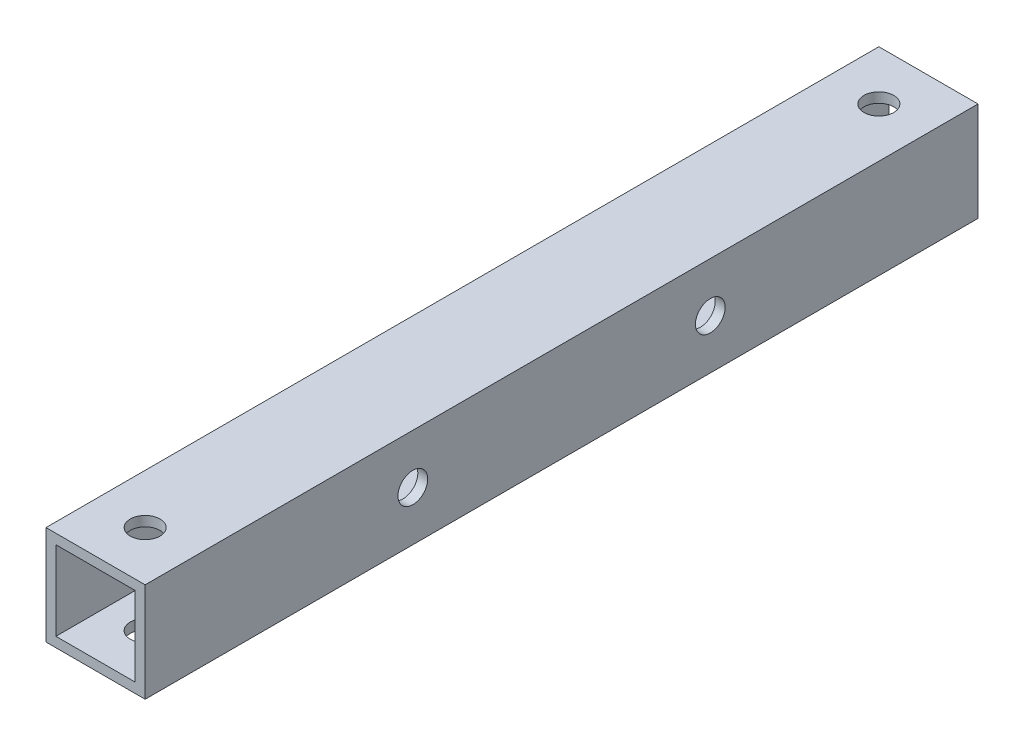
ISO-10303-21;
HEADER;
FILE_DESCRIPTION(('STEP AP214'),'2;1');
FILE_NAME('part.step','',(''),(''),'','','');
FILE_SCHEMA(('AUTOMOTIVE_DESIGN { 1 0 10303 214 1 1 1 1 }'));
ENDSEC;
DATA;
#1=APPLICATION_CONTEXT('core data for automotive mechanical design processes');
#2=APPLICATION_PROTOCOL_DEFINITION('international standard','automotive_design',2000,#1);
#3=PRODUCT_CONTEXT('',#1,'mechanical');
#4=PRODUCT('Part','Part','',(#3));
#5=PRODUCT_RELATED_PRODUCT_CATEGORY('part','',(#4));
#6=PRODUCT_DEFINITION_FORMATION('','',#4);
#7=PRODUCT_DEFINITION_CONTEXT('part definition',#1,'design');
#8=PRODUCT_DEFINITION('design','',#6,#7);
#9=PRODUCT_DEFINITION_SHAPE('','',#8);
#10=(LENGTH_UNIT() NAMED_UNIT(*) SI_UNIT(.MILLI.,.METRE.));
#11=(NAMED_UNIT(*) PLANE_ANGLE_UNIT() SI_UNIT($,.RADIAN.));
#12=(NAMED_UNIT(*) SI_UNIT($,.STERADIAN.) SOLID_ANGLE_UNIT());
#13=UNCERTAINTY_MEASURE_WITH_UNIT(LENGTH_MEASURE(1.E-05),#10,'distance_accuracy_value','');
#14=(GEOMETRIC_REPRESENTATION_CONTEXT(3) GLOBAL_UNCERTAINTY_ASSIGNED_CONTEXT((#13)) GLOBAL_UNIT_ASSIGNED_CONTEXT((#10,
#11,#12)) REPRESENTATION_CONTEXT('',''));
#15=CARTESIAN_POINT('',(0.,0.,0.));
#16=DIRECTION('',(0.,0.,1.));
#17=DIRECTION('',(1.,0.,0.));
#18=AXIS2_PLACEMENT_3D('',#15,#16,#17);
#19=CARTESIAN_POINT('',(0.,0.,84.));
#20=DIRECTION('',(0.,0.,1.));
#21=DIRECTION('',(1.,0.,0.));
#22=AXIS2_PLACEMENT_3D('',#19,#20,#21);
#23=PLANE('',#22);
#24=DIRECTION('',(0.,-1.,0.));
#25=VECTOR('',#24,1.);
#26=CARTESIAN_POINT('',(-5.,5.,84.));
#27=LINE('',#26,#25);
#28=CARTESIAN_POINT('',(-5.,5.,84.));
#29=VERTEX_POINT('',#28);
#30=CARTESIAN_POINT('',(-5.,-5.,84.));
#31=VERTEX_POINT('',#30);
#32=EDGE_CURVE('E168',#29,#31,#27,.T.);
#33=ORIENTED_EDGE('',*,*,#32,.T.);
#34=DIRECTION('',(1.,0.,0.));
#35=VECTOR('',#34,1.);
#36=CARTESIAN_POINT('',(-5.,-5.,84.));
#37=LINE('',#36,#35);
#38=CARTESIAN_POINT('',(5.,-5.,84.));
#39=VERTEX_POINT('',#38);
#40=EDGE_CURVE('E171',#31,#39,#37,.T.);
#41=ORIENTED_EDGE('',*,*,#40,.T.);
#42=DIRECTION('',(0.,1.,0.));
#43=VECTOR('',#42,1.);
#44=CARTESIAN_POINT('',(5.,5.,84.));
#45=LINE('',#44,#43);
#46=CARTESIAN_POINT('',(5.,5.,84.));
#47=VERTEX_POINT('',#46);
#48=EDGE_CURVE('E174',#39,#47,#45,.T.);
#49=ORIENTED_EDGE('',*,*,#48,.T.);
#50=DIRECTION('',(-1.,0.,0.));
#51=VECTOR('',#50,1.);
#52=CARTESIAN_POINT('',(-5.,5.,84.));
#53=LINE('',#52,#51);
#54=EDGE_CURVE('E176',#47,#29,#53,.T.);
#55=ORIENTED_EDGE('',*,*,#54,.T.);
#56=EDGE_LOOP('',(#33,#41,#49,#55));
#57=FACE_BOUND('',#56,.T.);
#58=DIRECTION('',(1.,0.,0.));
#59=VECTOR('',#58,1.);
#60=CARTESIAN_POINT('',(-5.,-4.,84.));
#61=LINE('',#60,#59);
#62=CARTESIAN_POINT('',(-4.,-4.,84.));
#63=VERTEX_POINT('',#62);
#64=CARTESIAN_POINT('',(4.,-4.,84.));
#65=VERTEX_POINT('',#64);
#66=EDGE_CURVE('E138',#63,#65,#61,.T.);
#67=ORIENTED_EDGE('',*,*,#66,.F.);
#68=DIRECTION('',(0.,-1.,0.));
#69=VECTOR('',#68,1.);
#70=CARTESIAN_POINT('',(-4.,5.,84.));
#71=LINE('',#70,#69);
#72=CARTESIAN_POINT('',(-4.,4.,84.));
#73=VERTEX_POINT('',#72);
#74=EDGE_CURVE('E130',#73,#63,#71,.T.);
#75=ORIENTED_EDGE('',*,*,#74,.F.);
#76=DIRECTION('',(-1.,0.,0.));
#77=VECTOR('',#76,1.);
#78=CARTESIAN_POINT('',(-5.,4.,84.));
#79=LINE('',#78,#77);
#80=CARTESIAN_POINT('',(4.,4.,84.));
#81=VERTEX_POINT('',#80);
#82=EDGE_CURVE('E152',#81,#73,#79,.T.);
#83=ORIENTED_EDGE('',*,*,#82,.F.);
#84=DIRECTION('',(0.,1.,0.));
#85=VECTOR('',#84,1.);
#86=CARTESIAN_POINT('',(4.,5.,84.));
#87=LINE('',#86,#85);
#88=EDGE_CURVE('E150',#65,#81,#87,.T.);
#89=ORIENTED_EDGE('',*,*,#88,.F.);
#90=EDGE_LOOP('',(#67,#75,#83,#89));
#91=FACE_BOUND('',#90,.T.);
#92=ADVANCED_FACE('F63',(#57,#91),#23,.T.);
#93=CARTESIAN_POINT('',(0.,0.,0.));
#94=DIRECTION('',(0.,0.,1.));
#95=DIRECTION('',(1.,0.,0.));
#96=AXIS2_PLACEMENT_3D('',#93,#94,#95);
#97=PLANE('',#96);
#98=DIRECTION('',(0.,-1.,0.));
#99=VECTOR('',#98,1.);
#100=CARTESIAN_POINT('',(-5.,5.,0.));
#101=LINE('',#100,#99);
#102=CARTESIAN_POINT('',(-5.,5.,0.));
#103=VERTEX_POINT('',#102);
#104=CARTESIAN_POINT('',(-5.,-5.,0.));
#105=VERTEX_POINT('',#104);
#106=EDGE_CURVE('E146',#103,#105,#101,.T.);
#107=ORIENTED_EDGE('',*,*,#106,.F.);
#108=DIRECTION('',(-1.,0.,0.));
#109=VECTOR('',#108,1.);
#110=CARTESIAN_POINT('',(-5.,5.,0.));
#111=LINE('',#110,#109);
#112=CARTESIAN_POINT('',(5.,5.,0.));
#113=VERTEX_POINT('',#112);
#114=EDGE_CURVE('E172',#113,#103,#111,.T.);
#115=ORIENTED_EDGE('',*,*,#114,.F.);
#116=DIRECTION('',(0.,1.,0.));
#117=VECTOR('',#116,1.);
#118=CARTESIAN_POINT('',(5.,5.,0.));
#119=LINE('',#118,#117);
#120=CARTESIAN_POINT('',(5.,-5.,0.));
#121=VERTEX_POINT('',#120);
#122=EDGE_CURVE('E183',#121,#113,#119,.T.);
#123=ORIENTED_EDGE('',*,*,#122,.F.);
#124=DIRECTION('',(1.,0.,0.));
#125=VECTOR('',#124,1.);
#126=CARTESIAN_POINT('',(-5.,-5.,0.));
#127=LINE('',#126,#125);
#128=EDGE_CURVE('E181',#105,#121,#127,.T.);
#129=ORIENTED_EDGE('',*,*,#128,.F.);
#130=EDGE_LOOP('',(#107,#115,#123,#129));
#131=FACE_BOUND('',#130,.T.);
#132=DIRECTION('',(0.,-1.,0.));
#133=VECTOR('',#132,1.);
#134=CARTESIAN_POINT('',(-4.,5.,0.));
#135=LINE('',#134,#133);
#136=CARTESIAN_POINT('',(-4.,4.,0.));
#137=VERTEX_POINT('',#136);
#138=CARTESIAN_POINT('',(-4.,-4.,0.));
#139=VERTEX_POINT('',#138);
#140=EDGE_CURVE('E88',#137,#139,#135,.T.);
#141=ORIENTED_EDGE('',*,*,#140,.T.);
#142=DIRECTION('',(1.,0.,0.));
#143=VECTOR('',#142,1.);
#144=CARTESIAN_POINT('',(-5.,-4.,0.));
#145=LINE('',#144,#143);
#146=CARTESIAN_POINT('',(4.,-4.,0.));
#147=VERTEX_POINT('',#146);
#148=EDGE_CURVE('E145',#139,#147,#145,.T.);
#149=ORIENTED_EDGE('',*,*,#148,.T.);
#150=DIRECTION('',(0.,1.,0.));
#151=VECTOR('',#150,1.);
#152=CARTESIAN_POINT('',(4.,5.,0.));
#153=LINE('',#152,#151);
#154=CARTESIAN_POINT('',(4.,4.,0.));
#155=VERTEX_POINT('',#154);
#156=EDGE_CURVE('E160',#147,#155,#153,.T.);
#157=ORIENTED_EDGE('',*,*,#156,.T.);
#158=DIRECTION('',(-1.,0.,0.));
#159=VECTOR('',#158,1.);
#160=CARTESIAN_POINT('',(-5.,4.,0.));
#161=LINE('',#160,#159);
#162=EDGE_CURVE('E139',#155,#137,#161,.T.);
#163=ORIENTED_EDGE('',*,*,#162,.T.);
#164=EDGE_LOOP('',(#141,#149,#157,#163));
#165=FACE_BOUND('',#164,.T.);
#166=ADVANCED_FACE('F260',(#131,#165),#97,.F.);
#167=CARTESIAN_POINT('',(-5.,5.,84.));
#168=DIRECTION('',(1.,0.,0.));
#169=DIRECTION('',(0.,0.,-1.));
#170=AXIS2_PLACEMENT_3D('',#167,#168,#169);
#171=PLANE('',#170);
#172=CARTESIAN_POINT('',(-5.,0.,57.));
#173=DIRECTION('',(1.,0.,0.));
#174=DIRECTION('',(0.,0.,-1.));
#175=AXIS2_PLACEMENT_3D('',#172,#173,#174);
#176=CIRCLE('',#175,1.5);
#177=CARTESIAN_POINT('',(-5.,0.,55.5));
#178=VERTEX_POINT('',#177);
#179=EDGE_CURVE('E197',#178,#178,#176,.T.);
#180=ORIENTED_EDGE('',*,*,#179,.T.);
#181=EDGE_LOOP('',(#180));
#182=FACE_BOUND('',#181,.T.);
#183=CARTESIAN_POINT('',(-5.,0.,27.));
#184=DIRECTION('',(1.,0.,0.));
#185=DIRECTION('',(0.,0.,-1.));
#186=AXIS2_PLACEMENT_3D('',#183,#184,#185);
#187=CIRCLE('',#186,1.5);
#188=CARTESIAN_POINT('',(-5.,0.,25.5));
#189=VERTEX_POINT('',#188);
#190=EDGE_CURVE('E225',#189,#189,#187,.T.);
#191=ORIENTED_EDGE('',*,*,#190,.T.);
#192=EDGE_LOOP('',(#191));
#193=FACE_BOUND('',#192,.T.);
#194=ORIENTED_EDGE('',*,*,#106,.T.);
#195=DIRECTION('',(0.,0.,-1.));
#196=VECTOR('',#195,1.);
#197=CARTESIAN_POINT('',(-5.,-5.,84.));
#198=LINE('',#197,#196);
#199=EDGE_CURVE('E12',#31,#105,#198,.T.);
#200=ORIENTED_EDGE('',*,*,#199,.F.);
#201=ORIENTED_EDGE('',*,*,#32,.F.);
#202=DIRECTION('',(0.,0.,-1.));
#203=VECTOR('',#202,1.);
#204=CARTESIAN_POINT('',(-5.,5.,84.));
#205=LINE('',#204,#203);
#206=EDGE_CURVE('E178',#29,#103,#205,.T.);
#207=ORIENTED_EDGE('',*,*,#206,.T.);
#208=EDGE_LOOP('',(#194,#200,#201,#207));
#209=FACE_BOUND('',#208,.T.);
#210=ADVANCED_FACE('F65',(#182,#193,#209),#171,.F.);
#211=CARTESIAN_POINT('',(-5.,-5.,84.));
#212=DIRECTION('',(0.,1.,0.));
#213=DIRECTION('',(0.,0.,1.));
#214=AXIS2_PLACEMENT_3D('',#211,#212,#213);
#215=PLANE('',#214);
#216=CARTESIAN_POINT('',(0.,-5.,5.));
#217=DIRECTION('',(0.,1.,0.));
#218=DIRECTION('',(0.,0.,1.));
#219=AXIS2_PLACEMENT_3D('',#216,#217,#218);
#220=CIRCLE('',#219,1.5);
#221=CARTESIAN_POINT('',(0.,-5.,6.5));
#222=VERTEX_POINT('',#221);
#223=EDGE_CURVE('E203',#222,#222,#220,.T.);
#224=ORIENTED_EDGE('',*,*,#223,.T.);
#225=EDGE_LOOP('',(#224));
#226=FACE_BOUND('',#225,.T.);
#227=CARTESIAN_POINT('',(0.,-5.,79.));
#228=DIRECTION('',(0.,1.,0.));
#229=DIRECTION('',(0.,0.,1.));
#230=AXIS2_PLACEMENT_3D('',#227,#228,#229);
#231=CIRCLE('',#230,1.5);
#232=CARTESIAN_POINT('',(0.,-5.,80.5));
#233=VERTEX_POINT('',#232);
#234=EDGE_CURVE('E219',#233,#233,#231,.T.);
#235=ORIENTED_EDGE('',*,*,#234,.T.);
#236=EDGE_LOOP('',(#235));
#237=FACE_BOUND('',#236,.T.);
#238=ORIENTED_EDGE('',*,*,#128,.T.);
#239=DIRECTION('',(0.,0.,-1.));
#240=VECTOR('',#239,1.);
#241=CARTESIAN_POINT('',(5.,-5.,84.));
#242=LINE('',#241,#240);
#243=EDGE_CURVE('E72',#39,#121,#242,.T.);
#244=ORIENTED_EDGE('',*,*,#243,.F.);
#245=ORIENTED_EDGE('',*,*,#40,.F.);
#246=ORIENTED_EDGE('',*,*,#199,.T.);
#247=EDGE_LOOP('',(#238,#244,#245,#246));
#248=FACE_BOUND('',#247,.T.);
#249=ADVANCED_FACE('F259',(#226,#237,#248),#215,.F.);
#250=CARTESIAN_POINT('',(5.,5.,84.));
#251=DIRECTION('',(-1.,0.,0.));
#252=DIRECTION('',(0.,0.,1.));
#253=AXIS2_PLACEMENT_3D('',#250,#251,#252);
#254=PLANE('',#253);
#255=CARTESIAN_POINT('',(5.,0.,57.));
#256=DIRECTION('',(1.,0.,0.));
#257=DIRECTION('',(0.,0.,-1.));
#258=AXIS2_PLACEMENT_3D('',#255,#256,#257);
#259=CIRCLE('',#258,1.5);
#260=CARTESIAN_POINT('',(5.,0.,55.5));
#261=VERTEX_POINT('',#260);
#262=EDGE_CURVE('E228',#261,#261,#259,.T.);
#263=ORIENTED_EDGE('',*,*,#262,.F.);
#264=EDGE_LOOP('',(#263));
#265=FACE_BOUND('',#264,.T.);
#266=CARTESIAN_POINT('',(5.,0.,27.));
#267=DIRECTION('',(1.,0.,0.));
#268=DIRECTION('',(0.,0.,-1.));
#269=AXIS2_PLACEMENT_3D('',#266,#267,#268);
#270=CIRCLE('',#269,1.5);
#271=CARTESIAN_POINT('',(5.,0.,25.5));
#272=VERTEX_POINT('',#271);
#273=EDGE_CURVE('E231',#272,#272,#270,.T.);
#274=ORIENTED_EDGE('',*,*,#273,.F.);
#275=EDGE_LOOP('',(#274));
#276=FACE_BOUND('',#275,.T.);
#277=ORIENTED_EDGE('',*,*,#122,.T.);
#278=DIRECTION('',(0.,0.,-1.));
#279=VECTOR('',#278,1.);
#280=CARTESIAN_POINT('',(5.,5.,84.));
#281=LINE('',#280,#279);
#282=EDGE_CURVE('E188',#47,#113,#281,.T.);
#283=ORIENTED_EDGE('',*,*,#282,.F.);
#284=ORIENTED_EDGE('',*,*,#48,.F.);
#285=ORIENTED_EDGE('',*,*,#243,.T.);
#286=EDGE_LOOP('',(#277,#283,#284,#285));
#287=FACE_BOUND('',#286,.T.);
#288=ADVANCED_FACE('F278',(#265,#276,#287),#254,.F.);
#289=CARTESIAN_POINT('',(-5.,5.,84.));
#290=DIRECTION('',(0.,-1.,0.));
#291=DIRECTION('',(0.,0.,-1.));
#292=AXIS2_PLACEMENT_3D('',#289,#290,#291);
#293=PLANE('',#292);
#294=CARTESIAN_POINT('',(0.,5.,5.));
#295=DIRECTION('',(0.,1.,0.));
#296=DIRECTION('',(0.,0.,1.));
#297=AXIS2_PLACEMENT_3D('',#294,#295,#296);
#298=CIRCLE('',#297,1.5);
#299=CARTESIAN_POINT('',(0.,5.,6.5));
#300=VERTEX_POINT('',#299);
#301=EDGE_CURVE('E209',#300,#300,#298,.T.);
#302=ORIENTED_EDGE('',*,*,#301,.F.);
#303=EDGE_LOOP('',(#302));
#304=FACE_BOUND('',#303,.T.);
#305=CARTESIAN_POINT('',(0.,5.,79.));
#306=DIRECTION('',(0.,1.,0.));
#307=DIRECTION('',(0.,0.,1.));
#308=AXIS2_PLACEMENT_3D('',#305,#306,#307);
#309=CIRCLE('',#308,1.5);
#310=CARTESIAN_POINT('',(0.,5.,80.5));
#311=VERTEX_POINT('',#310);
#312=EDGE_CURVE('E214',#311,#311,#309,.T.);
#313=ORIENTED_EDGE('',*,*,#312,.F.);
#314=EDGE_LOOP('',(#313));
#315=FACE_BOUND('',#314,.T.);
#316=ORIENTED_EDGE('',*,*,#114,.T.);
#317=ORIENTED_EDGE('',*,*,#206,.F.);
#318=ORIENTED_EDGE('',*,*,#54,.F.);
#319=ORIENTED_EDGE('',*,*,#282,.T.);
#320=EDGE_LOOP('',(#316,#317,#318,#319));
#321=FACE_BOUND('',#320,.T.);
#322=ADVANCED_FACE('F245',(#304,#315,#321),#293,.F.);
#323=CARTESIAN_POINT('',(-4.,5.,84.));
#324=DIRECTION('',(1.,0.,0.));
#325=DIRECTION('',(0.,0.,-1.));
#326=AXIS2_PLACEMENT_3D('',#323,#324,#325);
#327=PLANE('',#326);
#328=CARTESIAN_POINT('',(-4.,0.,57.));
#329=DIRECTION('',(1.,0.,0.));
#330=DIRECTION('',(0.,0.,-1.));
#331=AXIS2_PLACEMENT_3D('',#328,#329,#330);
#332=CIRCLE('',#331,1.5);
#333=CARTESIAN_POINT('',(-4.,0.,55.5));
#334=VERTEX_POINT('',#333);
#335=EDGE_CURVE('E158',#334,#334,#332,.T.);
#336=ORIENTED_EDGE('',*,*,#335,.F.);
#337=EDGE_LOOP('',(#336));
#338=FACE_BOUND('',#337,.T.);
#339=CARTESIAN_POINT('',(-4.,0.,27.));
#340=DIRECTION('',(1.,0.,0.));
#341=DIRECTION('',(0.,0.,-1.));
#342=AXIS2_PLACEMENT_3D('',#339,#340,#341);
#343=CIRCLE('',#342,1.5);
#344=CARTESIAN_POINT('',(-4.,0.,25.5));
#345=VERTEX_POINT('',#344);
#346=EDGE_CURVE('E196',#345,#345,#343,.T.);
#347=ORIENTED_EDGE('',*,*,#346,.F.);
#348=EDGE_LOOP('',(#347));
#349=FACE_BOUND('',#348,.T.);
#350=ORIENTED_EDGE('',*,*,#140,.F.);
#351=DIRECTION('',(0.,0.,-1.));
#352=VECTOR('',#351,1.);
#353=CARTESIAN_POINT('',(-4.,4.,84.));
#354=LINE('',#353,#352);
#355=EDGE_CURVE('E134',#73,#137,#354,.T.);
#356=ORIENTED_EDGE('',*,*,#355,.F.);
#357=ORIENTED_EDGE('',*,*,#74,.T.);
#358=DIRECTION('',(0.,0.,-1.));
#359=VECTOR('',#358,1.);
#360=CARTESIAN_POINT('',(-4.,-4.,84.));
#361=LINE('',#360,#359);
#362=EDGE_CURVE('E133',#63,#139,#361,.T.);
#363=ORIENTED_EDGE('',*,*,#362,.T.);
#364=EDGE_LOOP('',(#350,#356,#357,#363));
#365=FACE_BOUND('',#364,.T.);
#366=ADVANCED_FACE('F132',(#338,#349,#365),#327,.T.);
#367=CARTESIAN_POINT('',(-5.,-4.,84.));
#368=DIRECTION('',(0.,1.,0.));
#369=DIRECTION('',(0.,0.,1.));
#370=AXIS2_PLACEMENT_3D('',#367,#368,#369);
#371=PLANE('',#370);
#372=CARTESIAN_POINT('',(0.,-4.,5.));
#373=DIRECTION('',(0.,1.,0.));
#374=DIRECTION('',(0.,0.,1.));
#375=AXIS2_PLACEMENT_3D('',#372,#373,#374);
#376=CIRCLE('',#375,1.5);
#377=CARTESIAN_POINT('',(0.,-4.,6.5));
#378=VERTEX_POINT('',#377);
#379=EDGE_CURVE('E222',#378,#378,#376,.T.);
#380=ORIENTED_EDGE('',*,*,#379,.F.);
#381=EDGE_LOOP('',(#380));
#382=FACE_BOUND('',#381,.T.);
#383=CARTESIAN_POINT('',(0.,-4.,79.));
#384=DIRECTION('',(0.,1.,0.));
#385=DIRECTION('',(0.,0.,1.));
#386=AXIS2_PLACEMENT_3D('',#383,#384,#385);
#387=CIRCLE('',#386,1.5);
#388=CARTESIAN_POINT('',(0.,-4.,80.5));
#389=VERTEX_POINT('',#388);
#390=EDGE_CURVE('E202',#389,#389,#387,.T.);
#391=ORIENTED_EDGE('',*,*,#390,.F.);
#392=EDGE_LOOP('',(#391));
#393=FACE_BOUND('',#392,.T.);
#394=ORIENTED_EDGE('',*,*,#148,.F.);
#395=ORIENTED_EDGE('',*,*,#362,.F.);
#396=ORIENTED_EDGE('',*,*,#66,.T.);
#397=DIRECTION('',(0.,0.,-1.));
#398=VECTOR('',#397,1.);
#399=CARTESIAN_POINT('',(4.,-4.,84.));
#400=LINE('',#399,#398);
#401=EDGE_CURVE('E147',#65,#147,#400,.T.);
#402=ORIENTED_EDGE('',*,*,#401,.T.);
#403=EDGE_LOOP('',(#394,#395,#396,#402));
#404=FACE_BOUND('',#403,.T.);
#405=ADVANCED_FACE('F142',(#382,#393,#404),#371,.T.);
#406=CARTESIAN_POINT('',(4.,5.,84.));
#407=DIRECTION('',(-1.,0.,0.));
#408=DIRECTION('',(0.,0.,1.));
#409=AXIS2_PLACEMENT_3D('',#406,#407,#408);
#410=PLANE('',#409);
#411=CARTESIAN_POINT('',(4.,0.,57.));
#412=DIRECTION('',(-1.,0.,0.));
#413=DIRECTION('',(0.,0.,1.));
#414=AXIS2_PLACEMENT_3D('',#411,#412,#413);
#415=CIRCLE('',#414,1.5);
#416=CARTESIAN_POINT('',(4.,0.,58.5));
#417=VERTEX_POINT('',#416);
#418=EDGE_CURVE('E198',#417,#417,#415,.T.);
#419=ORIENTED_EDGE('',*,*,#418,.F.);
#420=EDGE_LOOP('',(#419));
#421=FACE_BOUND('',#420,.T.);
#422=CARTESIAN_POINT('',(4.,0.,27.));
#423=DIRECTION('',(-1.,0.,0.));
#424=DIRECTION('',(0.,0.,1.));
#425=AXIS2_PLACEMENT_3D('',#422,#423,#424);
#426=CIRCLE('',#425,1.5);
#427=CARTESIAN_POINT('',(4.,0.,28.5));
#428=VERTEX_POINT('',#427);
#429=EDGE_CURVE('E193',#428,#428,#426,.T.);
#430=ORIENTED_EDGE('',*,*,#429,.F.);
#431=EDGE_LOOP('',(#430));
#432=FACE_BOUND('',#431,.T.);
#433=ORIENTED_EDGE('',*,*,#156,.F.);
#434=ORIENTED_EDGE('',*,*,#401,.F.);
#435=ORIENTED_EDGE('',*,*,#88,.T.);
#436=DIRECTION('',(0.,0.,-1.));
#437=VECTOR('',#436,1.);
#438=CARTESIAN_POINT('',(4.,4.,84.));
#439=LINE('',#438,#437);
#440=EDGE_CURVE('E80',#81,#155,#439,.T.);
#441=ORIENTED_EDGE('',*,*,#440,.T.);
#442=EDGE_LOOP('',(#433,#434,#435,#441));
#443=FACE_BOUND('',#442,.T.);
#444=ADVANCED_FACE('F299',(#421,#432,#443),#410,.T.);
#445=CARTESIAN_POINT('',(-5.,4.,84.));
#446=DIRECTION('',(0.,-1.,0.));
#447=DIRECTION('',(0.,0.,-1.));
#448=AXIS2_PLACEMENT_3D('',#445,#446,#447);
#449=PLANE('',#448);
#450=CARTESIAN_POINT('',(0.,4.,5.));
#451=DIRECTION('',(0.,-1.,0.));
#452=DIRECTION('',(0.,0.,-1.));
#453=AXIS2_PLACEMENT_3D('',#450,#451,#452);
#454=CIRCLE('',#453,1.5);
#455=CARTESIAN_POINT('',(0.,4.,3.5));
#456=VERTEX_POINT('',#455);
#457=EDGE_CURVE('E67',#456,#456,#454,.T.);
#458=ORIENTED_EDGE('',*,*,#457,.F.);
#459=EDGE_LOOP('',(#458));
#460=FACE_BOUND('',#459,.T.);
#461=CARTESIAN_POINT('',(0.,4.,79.));
#462=DIRECTION('',(0.,-1.,0.));
#463=DIRECTION('',(0.,0.,-1.));
#464=AXIS2_PLACEMENT_3D('',#461,#462,#463);
#465=CIRCLE('',#464,1.5);
#466=CARTESIAN_POINT('',(0.,4.,77.5));
#467=VERTEX_POINT('',#466);
#468=EDGE_CURVE('E200',#467,#467,#465,.T.);
#469=ORIENTED_EDGE('',*,*,#468,.F.);
#470=EDGE_LOOP('',(#469));
#471=FACE_BOUND('',#470,.T.);
#472=ORIENTED_EDGE('',*,*,#162,.F.);
#473=ORIENTED_EDGE('',*,*,#440,.F.);
#474=ORIENTED_EDGE('',*,*,#82,.T.);
#475=ORIENTED_EDGE('',*,*,#355,.T.);
#476=EDGE_LOOP('',(#472,#473,#474,#475));
#477=FACE_BOUND('',#476,.T.);
#478=ADVANCED_FACE('F303',(#460,#471,#477),#449,.T.);
#479=CARTESIAN_POINT('',(-5.,0.,27.));
#480=DIRECTION('',(1.,0.,0.));
#481=DIRECTION('',(0.,0.,-1.));
#482=AXIS2_PLACEMENT_3D('',#479,#480,#481);
#483=CYLINDRICAL_SURFACE('',#482,1.5);
#484=ORIENTED_EDGE('',*,*,#429,.T.);
#485=EDGE_LOOP('',(#484));
#486=FACE_BOUND('',#485,.T.);
#487=ORIENTED_EDGE('',*,*,#273,.T.);
#488=EDGE_LOOP('',(#487));
#489=FACE_BOUND('',#488,.T.);
#490=ADVANCED_FACE('F254',(#486,#489),#483,.F.);
#491=CARTESIAN_POINT('',(-5.,0.,57.));
#492=DIRECTION('',(1.,0.,0.));
#493=DIRECTION('',(0.,0.,-1.));
#494=AXIS2_PLACEMENT_3D('',#491,#492,#493);
#495=CYLINDRICAL_SURFACE('',#494,1.5);
#496=ORIENTED_EDGE('',*,*,#418,.T.);
#497=EDGE_LOOP('',(#496));
#498=FACE_BOUND('',#497,.T.);
#499=ORIENTED_EDGE('',*,*,#262,.T.);
#500=EDGE_LOOP('',(#499));
#501=FACE_BOUND('',#500,.T.);
#502=ADVANCED_FACE('F252',(#498,#501),#495,.F.);
#503=ORIENTED_EDGE('',*,*,#346,.T.);
#504=EDGE_LOOP('',(#503));
#505=FACE_BOUND('',#504,.T.);
#506=ORIENTED_EDGE('',*,*,#190,.F.);
#507=EDGE_LOOP('',(#506));
#508=FACE_BOUND('',#507,.T.);
#509=ADVANCED_FACE('F249',(#505,#508),#483,.F.);
#510=ORIENTED_EDGE('',*,*,#335,.T.);
#511=EDGE_LOOP('',(#510));
#512=FACE_BOUND('',#511,.T.);
#513=ORIENTED_EDGE('',*,*,#179,.F.);
#514=EDGE_LOOP('',(#513));
#515=FACE_BOUND('',#514,.T.);
#516=ADVANCED_FACE('F240',(#512,#515),#495,.F.);
#517=CARTESIAN_POINT('',(0.,-5.,79.));
#518=DIRECTION('',(0.,1.,0.));
#519=DIRECTION('',(0.,0.,1.));
#520=AXIS2_PLACEMENT_3D('',#517,#518,#519);
#521=CYLINDRICAL_SURFACE('',#520,1.5);
#522=ORIENTED_EDGE('',*,*,#468,.T.);
#523=EDGE_LOOP('',(#522));
#524=FACE_BOUND('',#523,.T.);
#525=ORIENTED_EDGE('',*,*,#312,.T.);
#526=EDGE_LOOP('',(#525));
#527=FACE_BOUND('',#526,.T.);
#528=ADVANCED_FACE('F313',(#524,#527),#521,.F.);
#529=CARTESIAN_POINT('',(0.,-5.,5.));
#530=DIRECTION('',(0.,1.,0.));
#531=DIRECTION('',(0.,0.,1.));
#532=AXIS2_PLACEMENT_3D('',#529,#530,#531);
#533=CYLINDRICAL_SURFACE('',#532,1.5);
#534=ORIENTED_EDGE('',*,*,#457,.T.);
#535=EDGE_LOOP('',(#534));
#536=FACE_BOUND('',#535,.T.);
#537=ORIENTED_EDGE('',*,*,#301,.T.);
#538=EDGE_LOOP('',(#537));
#539=FACE_BOUND('',#538,.T.);
#540=ADVANCED_FACE('F316',(#536,#539),#533,.F.);
#541=ORIENTED_EDGE('',*,*,#390,.T.);
#542=EDGE_LOOP('',(#541));
#543=FACE_BOUND('',#542,.T.);
#544=ORIENTED_EDGE('',*,*,#234,.F.);
#545=EDGE_LOOP('',(#544));
#546=FACE_BOUND('',#545,.T.);
#547=ADVANCED_FACE('F317',(#543,#546),#521,.F.);
#548=ORIENTED_EDGE('',*,*,#379,.T.);
#549=EDGE_LOOP('',(#548));
#550=FACE_BOUND('',#549,.T.);
#551=ORIENTED_EDGE('',*,*,#223,.F.);
#552=EDGE_LOOP('',(#551));
#553=FACE_BOUND('',#552,.T.);
#554=ADVANCED_FACE('F320',(#550,#553),#533,.F.);
#555=CLOSED_SHELL('',(#92,#166,#210,#249,#288,#322,#366,#405,#444,#478,#490,#502,#509,#516,#528,
#540,#547,#554));
#556=MANIFOLD_SOLID_BREP('B2',#555);
#557=ADVANCED_BREP_SHAPE_REPRESENTATION('',(#18,#556),#14);
#558=SHAPE_DEFINITION_REPRESENTATION(#9,#557);
ENDSEC;
END-ISO-10303-21;
